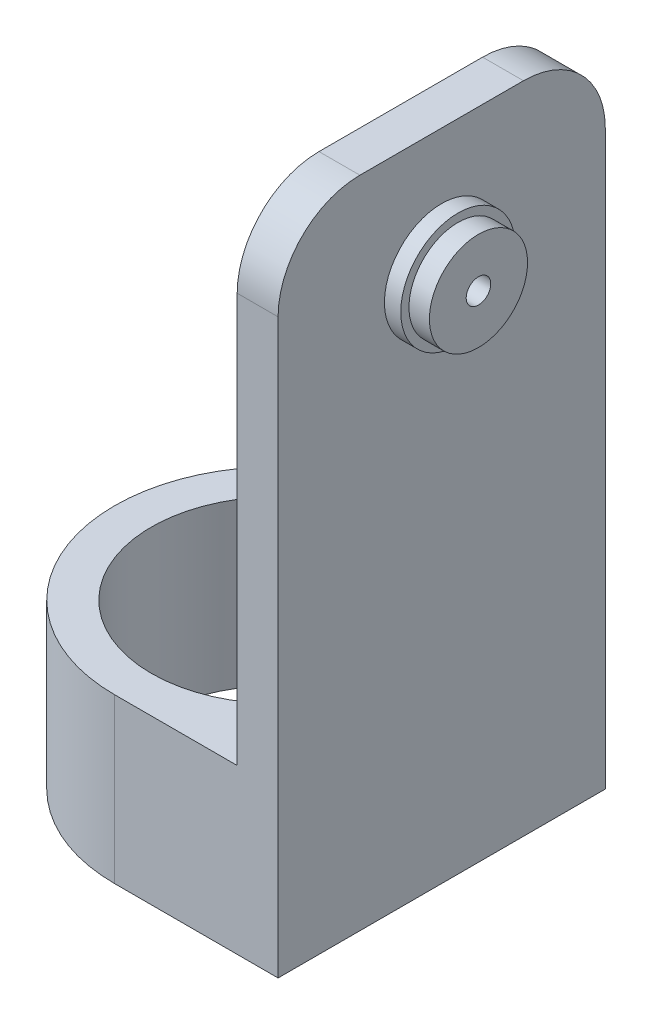
ISO-10303-21;
HEADER;
FILE_DESCRIPTION(('STEP AP214'),'2;1');
FILE_NAME('part.step','',(''),(''),'','','');
FILE_SCHEMA(('AUTOMOTIVE_DESIGN { 1 0 10303 214 1 1 1 1 }'));
ENDSEC;
DATA;
#1=APPLICATION_CONTEXT('core data for automotive mechanical design processes');
#2=APPLICATION_PROTOCOL_DEFINITION('international standard','automotive_design',2000,#1);
#3=PRODUCT_CONTEXT('',#1,'mechanical');
#4=PRODUCT('Part','Part','',(#3));
#5=PRODUCT_RELATED_PRODUCT_CATEGORY('part','',(#4));
#6=PRODUCT_DEFINITION_FORMATION('','',#4);
#7=PRODUCT_DEFINITION_CONTEXT('part definition',#1,'design');
#8=PRODUCT_DEFINITION('design','',#6,#7);
#9=PRODUCT_DEFINITION_SHAPE('','',#8);
#10=(LENGTH_UNIT() NAMED_UNIT(*) SI_UNIT(.MILLI.,.METRE.));
#11=(NAMED_UNIT(*) PLANE_ANGLE_UNIT() SI_UNIT($,.RADIAN.));
#12=(NAMED_UNIT(*) SI_UNIT($,.STERADIAN.) SOLID_ANGLE_UNIT());
#13=UNCERTAINTY_MEASURE_WITH_UNIT(LENGTH_MEASURE(1.E-05),#10,'distance_accuracy_value','');
#14=(GEOMETRIC_REPRESENTATION_CONTEXT(3) GLOBAL_UNCERTAINTY_ASSIGNED_CONTEXT((#13)) GLOBAL_UNIT_ASSIGNED_CONTEXT((#10,
#11,#12)) REPRESENTATION_CONTEXT('',''));
#15=CARTESIAN_POINT('',(0.,0.,0.));
#16=DIRECTION('',(0.,0.,1.));
#17=DIRECTION('',(1.,0.,0.));
#18=AXIS2_PLACEMENT_3D('',#15,#16,#17);
#19=CARTESIAN_POINT('',(0.,20.,0.));
#20=DIRECTION('',(0.,1.,0.));
#21=DIRECTION('',(0.,0.,1.));
#22=AXIS2_PLACEMENT_3D('',#19,#20,#21);
#23=PLANE('',#22);
#24=DIRECTION('',(0.,0.,1.));
#25=VECTOR('',#24,1.);
#26=CARTESIAN_POINT('',(15.,20.,-20.));
#27=LINE('',#26,#25);
#28=CARTESIAN_POINT('',(15.,20.,-20.));
#29=VERTEX_POINT('',#28);
#30=CARTESIAN_POINT('',(15.,20.,-3.90512483795333));
#31=VERTEX_POINT('',#30);
#32=EDGE_CURVE('E145',#29,#31,#27,.T.);
#33=ORIENTED_EDGE('',*,*,#32,.F.);
#34=DIRECTION('',(-1.,0.,0.));
#35=VECTOR('',#34,1.);
#36=CARTESIAN_POINT('',(0.,20.,-20.));
#37=LINE('',#36,#35);
#38=CARTESIAN_POINT('',(0.,20.,-20.));
#39=VERTEX_POINT('',#38);
#40=EDGE_CURVE('E213',#29,#39,#37,.T.);
#41=ORIENTED_EDGE('',*,*,#40,.T.);
#42=CARTESIAN_POINT('',(0.,20.,0.));
#43=DIRECTION('',(0.,1.,0.));
#44=DIRECTION('',(0.,0.,1.));
#45=AXIS2_PLACEMENT_3D('',#42,#43,#44);
#46=CIRCLE('',#45,20.);
#47=CARTESIAN_POINT('',(0.,20.,20.));
#48=VERTEX_POINT('',#47);
#49=EDGE_CURVE('E130',#39,#48,#46,.T.);
#50=ORIENTED_EDGE('',*,*,#49,.T.);
#51=DIRECTION('',(1.,0.,0.));
#52=VECTOR('',#51,1.);
#53=CARTESIAN_POINT('',(0.,20.,20.));
#54=LINE('',#53,#52);
#55=CARTESIAN_POINT('',(15.,20.,20.));
#56=VERTEX_POINT('',#55);
#57=EDGE_CURVE('E116',#48,#56,#54,.T.);
#58=ORIENTED_EDGE('',*,*,#57,.T.);
#59=CARTESIAN_POINT('',(15.,20.,3.90512483795332));
#60=VERTEX_POINT('',#59);
#61=EDGE_CURVE('E127',#60,#56,#27,.T.);
#62=ORIENTED_EDGE('',*,*,#61,.F.);
#63=CARTESIAN_POINT('',(0.,20.,0.));
#64=DIRECTION('',(0.,1.,0.));
#65=DIRECTION('',(0.,0.,1.));
#66=AXIS2_PLACEMENT_3D('',#63,#64,#65);
#67=CIRCLE('',#66,15.5);
#68=EDGE_CURVE('E218',#31,#60,#67,.T.);
#69=ORIENTED_EDGE('',*,*,#68,.F.);
#70=EDGE_LOOP('',(#33,#41,#50,#58,#62,#69));
#71=FACE_BOUND('',#70,.T.);
#72=ADVANCED_FACE('F40',(#71),#23,.T.);
#73=CARTESIAN_POINT('',(0.,0.,0.));
#74=DIRECTION('',(0.,1.,0.));
#75=DIRECTION('',(0.,0.,1.));
#76=AXIS2_PLACEMENT_3D('',#73,#74,#75);
#77=PLANE('',#76);
#78=DIRECTION('',(0.,0.,-1.));
#79=VECTOR('',#78,1.);
#80=CARTESIAN_POINT('',(20.,0.,-20.));
#81=LINE('',#80,#79);
#82=CARTESIAN_POINT('',(20.,0.,20.));
#83=VERTEX_POINT('',#82);
#84=CARTESIAN_POINT('',(20.,0.,-20.));
#85=VERTEX_POINT('',#84);
#86=EDGE_CURVE('E224',#83,#85,#81,.T.);
#87=ORIENTED_EDGE('',*,*,#86,.F.);
#88=DIRECTION('',(1.,0.,0.));
#89=VECTOR('',#88,1.);
#90=CARTESIAN_POINT('',(0.,0.,20.));
#91=LINE('',#90,#89);
#92=CARTESIAN_POINT('',(0.,0.,20.));
#93=VERTEX_POINT('',#92);
#94=EDGE_CURVE('E228',#93,#83,#91,.T.);
#95=ORIENTED_EDGE('',*,*,#94,.F.);
#96=CARTESIAN_POINT('',(0.,0.,0.));
#97=DIRECTION('',(0.,1.,0.));
#98=DIRECTION('',(0.,0.,1.));
#99=AXIS2_PLACEMENT_3D('',#96,#97,#98);
#100=CIRCLE('',#99,20.);
#101=CARTESIAN_POINT('',(0.,0.,-20.));
#102=VERTEX_POINT('',#101);
#103=EDGE_CURVE('E235',#102,#93,#100,.T.);
#104=ORIENTED_EDGE('',*,*,#103,.F.);
#105=DIRECTION('',(-1.,0.,0.));
#106=VECTOR('',#105,1.);
#107=CARTESIAN_POINT('',(0.,0.,-20.));
#108=LINE('',#107,#106);
#109=EDGE_CURVE('E232',#85,#102,#108,.T.);
#110=ORIENTED_EDGE('',*,*,#109,.F.);
#111=EDGE_LOOP('',(#87,#95,#104,#110));
#112=FACE_BOUND('',#111,.T.);
#113=CARTESIAN_POINT('',(0.,0.,0.));
#114=DIRECTION('',(0.,1.,0.));
#115=DIRECTION('',(0.,0.,1.));
#116=AXIS2_PLACEMENT_3D('',#113,#114,#115);
#117=CIRCLE('',#116,15.5);
#118=CARTESIAN_POINT('',(0.,0.,15.5));
#119=VERTEX_POINT('',#118);
#120=EDGE_CURVE('E214',#119,#119,#117,.T.);
#121=ORIENTED_EDGE('',*,*,#120,.T.);
#122=EDGE_LOOP('',(#121));
#123=FACE_BOUND('',#122,.T.);
#124=ADVANCED_FACE('F253',(#112,#123),#77,.F.);
#125=CARTESIAN_POINT('',(20.,20.,-20.));
#126=DIRECTION('',(-1.,0.,0.));
#127=DIRECTION('',(0.,0.,1.));
#128=AXIS2_PLACEMENT_3D('',#125,#126,#127);
#129=PLANE('',#128);
#130=CARTESIAN_POINT('',(20.,65.,0.));
#131=DIRECTION('',(-1.,0.,0.));
#132=DIRECTION('',(0.,0.,1.));
#133=AXIS2_PLACEMENT_3D('',#130,#131,#132);
#134=CIRCLE('',#133,7.);
#135=CARTESIAN_POINT('',(20.,65.,7.));
#136=VERTEX_POINT('',#135);
#137=EDGE_CURVE('E142',#136,#136,#134,.F.);
#138=ORIENTED_EDGE('',*,*,#137,.F.);
#139=EDGE_LOOP('',(#138));
#140=FACE_BOUND('',#139,.T.);
#141=DIRECTION('',(0.,-1.,0.));
#142=VECTOR('',#141,1.);
#143=CARTESIAN_POINT('',(20.,20.,-20.));
#144=LINE('',#143,#142);
#145=CARTESIAN_POINT('',(20.,70.,-20.));
#146=VERTEX_POINT('',#145);
#147=EDGE_CURVE('E143',#146,#85,#144,.T.);
#148=ORIENTED_EDGE('',*,*,#147,.F.);
#149=CARTESIAN_POINT('',(20.,70.,-10.));
#150=DIRECTION('',(-1.,0.,0.));
#151=DIRECTION('',(0.,0.,1.));
#152=AXIS2_PLACEMENT_3D('',#149,#150,#151);
#153=CIRCLE('',#152,10.);
#154=CARTESIAN_POINT('',(20.,80.,-10.));
#155=VERTEX_POINT('',#154);
#156=EDGE_CURVE('E49',#146,#155,#153,.F.);
#157=ORIENTED_EDGE('',*,*,#156,.T.);
#158=DIRECTION('',(0.,0.,-1.));
#159=VECTOR('',#158,1.);
#160=CARTESIAN_POINT('',(20.,80.,-20.));
#161=LINE('',#160,#159);
#162=CARTESIAN_POINT('',(20.,80.,10.));
#163=VERTEX_POINT('',#162);
#164=EDGE_CURVE('E157',#163,#155,#161,.T.);
#165=ORIENTED_EDGE('',*,*,#164,.F.);
#166=CARTESIAN_POINT('',(20.,70.,10.));
#167=DIRECTION('',(-1.,0.,0.));
#168=DIRECTION('',(0.,0.,1.));
#169=AXIS2_PLACEMENT_3D('',#166,#167,#168);
#170=CIRCLE('',#169,10.);
#171=CARTESIAN_POINT('',(20.,70.,20.));
#172=VERTEX_POINT('',#171);
#173=EDGE_CURVE('E56',#163,#172,#170,.F.);
#174=ORIENTED_EDGE('',*,*,#173,.T.);
#175=DIRECTION('',(0.,-1.,0.));
#176=VECTOR('',#175,1.);
#177=CARTESIAN_POINT('',(20.,20.,20.));
#178=LINE('',#177,#176);
#179=EDGE_CURVE('E133',#172,#83,#178,.T.);
#180=ORIENTED_EDGE('',*,*,#179,.T.);
#181=ORIENTED_EDGE('',*,*,#86,.T.);
#182=EDGE_LOOP('',(#148,#157,#165,#174,#180,#181));
#183=FACE_BOUND('',#182,.T.);
#184=ADVANCED_FACE('F206',(#140,#183),#129,.F.);
#185=CARTESIAN_POINT('',(0.,20.,-20.));
#186=DIRECTION('',(0.,0.,1.));
#187=DIRECTION('',(1.,0.,0.));
#188=AXIS2_PLACEMENT_3D('',#185,#186,#187);
#189=PLANE('',#188);
#190=DIRECTION('',(0.,-1.,0.));
#191=VECTOR('',#190,1.);
#192=CARTESIAN_POINT('',(15.,80.,-20.));
#193=LINE('',#192,#191);
#194=CARTESIAN_POINT('',(15.,70.,-20.));
#195=VERTEX_POINT('',#194);
#196=EDGE_CURVE('E122',#195,#29,#193,.T.);
#197=ORIENTED_EDGE('',*,*,#196,.F.);
#198=DIRECTION('',(-1.,0.,0.));
#199=VECTOR('',#198,1.);
#200=CARTESIAN_POINT('',(0.,70.,-20.));
#201=LINE('',#200,#199);
#202=EDGE_CURVE('E64',#195,#146,#201,.F.);
#203=ORIENTED_EDGE('',*,*,#202,.T.);
#204=ORIENTED_EDGE('',*,*,#147,.T.);
#205=ORIENTED_EDGE('',*,*,#109,.T.);
#206=DIRECTION('',(0.,-1.,0.));
#207=VECTOR('',#206,1.);
#208=CARTESIAN_POINT('',(0.,20.,-20.));
#209=LINE('',#208,#207);
#210=EDGE_CURVE('E153',#39,#102,#209,.T.);
#211=ORIENTED_EDGE('',*,*,#210,.F.);
#212=ORIENTED_EDGE('',*,*,#40,.F.);
#213=EDGE_LOOP('',(#197,#203,#204,#205,#211,#212));
#214=FACE_BOUND('',#213,.T.);
#215=ADVANCED_FACE('F211',(#214),#189,.F.);
#216=CARTESIAN_POINT('',(0.,20.,0.));
#217=DIRECTION('',(0.,-1.,0.));
#218=DIRECTION('',(0.,0.,-1.));
#219=AXIS2_PLACEMENT_3D('',#216,#217,#218);
#220=CYLINDRICAL_SURFACE('',#219,20.);
#221=ORIENTED_EDGE('',*,*,#103,.T.);
#222=DIRECTION('',(0.,-1.,0.));
#223=VECTOR('',#222,1.);
#224=CARTESIAN_POINT('',(0.,20.,20.));
#225=LINE('',#224,#223);
#226=EDGE_CURVE('E242',#48,#93,#225,.T.);
#227=ORIENTED_EDGE('',*,*,#226,.F.);
#228=ORIENTED_EDGE('',*,*,#49,.F.);
#229=ORIENTED_EDGE('',*,*,#210,.T.);
#230=EDGE_LOOP('',(#221,#227,#228,#229));
#231=FACE_BOUND('',#230,.T.);
#232=ADVANCED_FACE('F248',(#231),#220,.T.);
#233=CARTESIAN_POINT('',(0.,20.,20.));
#234=DIRECTION('',(0.,0.,-1.));
#235=DIRECTION('',(-1.,0.,0.));
#236=AXIS2_PLACEMENT_3D('',#233,#234,#235);
#237=PLANE('',#236);
#238=ORIENTED_EDGE('',*,*,#179,.F.);
#239=DIRECTION('',(1.,0.,0.));
#240=VECTOR('',#239,1.);
#241=CARTESIAN_POINT('',(0.,70.,20.));
#242=LINE('',#241,#240);
#243=CARTESIAN_POINT('',(15.,70.,20.));
#244=VERTEX_POINT('',#243);
#245=EDGE_CURVE('E11',#172,#244,#242,.F.);
#246=ORIENTED_EDGE('',*,*,#245,.T.);
#247=DIRECTION('',(0.,-1.,0.));
#248=VECTOR('',#247,1.);
#249=CARTESIAN_POINT('',(15.,80.,20.));
#250=LINE('',#249,#248);
#251=EDGE_CURVE('E112',#244,#56,#250,.T.);
#252=ORIENTED_EDGE('',*,*,#251,.T.);
#253=ORIENTED_EDGE('',*,*,#57,.F.);
#254=ORIENTED_EDGE('',*,*,#226,.T.);
#255=ORIENTED_EDGE('',*,*,#94,.T.);
#256=EDGE_LOOP('',(#238,#246,#252,#253,#254,#255));
#257=FACE_BOUND('',#256,.T.);
#258=ADVANCED_FACE('F114',(#257),#237,.F.);
#259=CARTESIAN_POINT('',(0.,20.,0.));
#260=DIRECTION('',(0.,-1.,0.));
#261=DIRECTION('',(0.,0.,-1.));
#262=AXIS2_PLACEMENT_3D('',#259,#260,#261);
#263=CYLINDRICAL_SURFACE('',#262,15.5);
#264=EDGE_CURVE('E221',#60,#31,#67,.T.);
#265=ORIENTED_EDGE('',*,*,#264,.T.);
#266=ORIENTED_EDGE('',*,*,#68,.T.);
#267=EDGE_LOOP('',(#265,#266));
#268=FACE_BOUND('',#267,.T.);
#269=ORIENTED_EDGE('',*,*,#120,.F.);
#270=EDGE_LOOP('',(#269));
#271=FACE_BOUND('',#270,.T.);
#272=ADVANCED_FACE('F259',(#268,#271),#263,.F.);
#273=CARTESIAN_POINT('',(0.,20.,0.));
#274=DIRECTION('',(0.,-1.,0.));
#275=DIRECTION('',(0.,0.,-1.));
#276=AXIS2_PLACEMENT_3D('',#273,#274,#275);
#277=PLANE('',#276);
#278=ORIENTED_EDGE('',*,*,#264,.F.);
#279=EDGE_CURVE('E140',#31,#60,#27,.T.);
#280=ORIENTED_EDGE('',*,*,#279,.F.);
#281=EDGE_LOOP('',(#278,#280));
#282=FACE_BOUND('',#281,.T.);
#283=ADVANCED_FACE('F261',(#282),#277,.T.);
#284=CARTESIAN_POINT('',(15.,80.,-20.));
#285=DIRECTION('',(1.,0.,0.));
#286=DIRECTION('',(0.,0.,-1.));
#287=AXIS2_PLACEMENT_3D('',#284,#285,#286);
#288=PLANE('',#287);
#289=CARTESIAN_POINT('',(15.,65.,0.));
#290=DIRECTION('',(1.,0.,0.));
#291=DIRECTION('',(0.,0.,-1.));
#292=AXIS2_PLACEMENT_3D('',#289,#290,#291);
#293=CIRCLE('',#292,1.5);
#294=CARTESIAN_POINT('',(15.,65.,-1.5));
#295=VERTEX_POINT('',#294);
#296=EDGE_CURVE('E172',#295,#295,#293,.T.);
#297=ORIENTED_EDGE('',*,*,#296,.T.);
#298=EDGE_LOOP('',(#297));
#299=FACE_BOUND('',#298,.T.);
#300=DIRECTION('',(0.,0.,1.));
#301=VECTOR('',#300,1.);
#302=CARTESIAN_POINT('',(15.,80.,-20.));
#303=LINE('',#302,#301);
#304=CARTESIAN_POINT('',(15.,80.,-10.));
#305=VERTEX_POINT('',#304);
#306=CARTESIAN_POINT('',(15.,80.,10.));
#307=VERTEX_POINT('',#306);
#308=EDGE_CURVE('E123',#305,#307,#303,.T.);
#309=ORIENTED_EDGE('',*,*,#308,.F.);
#310=CARTESIAN_POINT('',(15.,70.,-10.));
#311=DIRECTION('',(1.,0.,0.));
#312=DIRECTION('',(0.,0.,-1.));
#313=AXIS2_PLACEMENT_3D('',#310,#311,#312);
#314=CIRCLE('',#313,10.);
#315=EDGE_CURVE('E199',#305,#195,#314,.F.);
#316=ORIENTED_EDGE('',*,*,#315,.T.);
#317=ORIENTED_EDGE('',*,*,#196,.T.);
#318=ORIENTED_EDGE('',*,*,#32,.T.);
#319=ORIENTED_EDGE('',*,*,#279,.T.);
#320=ORIENTED_EDGE('',*,*,#61,.T.);
#321=ORIENTED_EDGE('',*,*,#251,.F.);
#322=CARTESIAN_POINT('',(15.,70.,10.));
#323=DIRECTION('',(1.,0.,0.));
#324=DIRECTION('',(0.,0.,-1.));
#325=AXIS2_PLACEMENT_3D('',#322,#323,#324);
#326=CIRCLE('',#325,10.);
#327=EDGE_CURVE('E190',#244,#307,#326,.F.);
#328=ORIENTED_EDGE('',*,*,#327,.T.);
#329=EDGE_LOOP('',(#309,#316,#317,#318,#319,#320,#321,#328));
#330=FACE_BOUND('',#329,.T.);
#331=ADVANCED_FACE('F137',(#299,#330),#288,.F.);
#332=CARTESIAN_POINT('',(0.,80.,0.));
#333=DIRECTION('',(0.,-1.,0.));
#334=DIRECTION('',(0.,0.,-1.));
#335=AXIS2_PLACEMENT_3D('',#332,#333,#334);
#336=PLANE('',#335);
#337=ORIENTED_EDGE('',*,*,#164,.T.);
#338=DIRECTION('',(-1.,0.,0.));
#339=VECTOR('',#338,1.);
#340=CARTESIAN_POINT('',(0.,80.,-10.));
#341=LINE('',#340,#339);
#342=EDGE_CURVE('E188',#155,#305,#341,.T.);
#343=ORIENTED_EDGE('',*,*,#342,.T.);
#344=ORIENTED_EDGE('',*,*,#308,.T.);
#345=DIRECTION('',(1.,0.,0.));
#346=VECTOR('',#345,1.);
#347=CARTESIAN_POINT('',(0.,80.,10.));
#348=LINE('',#347,#346);
#349=EDGE_CURVE('E186',#307,#163,#348,.T.);
#350=ORIENTED_EDGE('',*,*,#349,.T.);
#351=EDGE_LOOP('',(#337,#343,#344,#350));
#352=FACE_BOUND('',#351,.T.);
#353=ADVANCED_FACE('F185',(#352),#336,.F.);
#354=CARTESIAN_POINT('',(22.,65.,0.));
#355=DIRECTION('',(-1.,0.,0.));
#356=DIRECTION('',(0.,0.,1.));
#357=AXIS2_PLACEMENT_3D('',#354,#355,#356);
#358=CYLINDRICAL_SURFACE('',#357,7.);
#359=CARTESIAN_POINT('',(22.,65.,0.));
#360=DIRECTION('',(1.,0.,0.));
#361=DIRECTION('',(0.,0.,-1.));
#362=AXIS2_PLACEMENT_3D('',#359,#360,#361);
#363=CIRCLE('',#362,7.);
#364=CARTESIAN_POINT('',(22.,65.,-7.));
#365=VERTEX_POINT('',#364);
#366=EDGE_CURVE('E159',#365,#365,#363,.T.);
#367=ORIENTED_EDGE('',*,*,#366,.F.);
#368=EDGE_LOOP('',(#367));
#369=FACE_BOUND('',#368,.T.);
#370=ORIENTED_EDGE('',*,*,#137,.T.);
#371=EDGE_LOOP('',(#370));
#372=FACE_BOUND('',#371,.T.);
#373=ADVANCED_FACE('F307',(#369,#372),#358,.T.);
#374=CARTESIAN_POINT('',(22.,65.,0.));
#375=DIRECTION('',(1.,0.,0.));
#376=DIRECTION('',(0.,0.,-1.));
#377=AXIS2_PLACEMENT_3D('',#374,#375,#376);
#378=PLANE('',#377);
#379=CARTESIAN_POINT('',(22.,65.,0.));
#380=DIRECTION('',(1.,0.,0.));
#381=DIRECTION('',(0.,0.,-1.));
#382=AXIS2_PLACEMENT_3D('',#379,#380,#381);
#383=CIRCLE('',#382,6.);
#384=CARTESIAN_POINT('',(22.,65.,-6.));
#385=VERTEX_POINT('',#384);
#386=EDGE_CURVE('E150',#385,#385,#383,.T.);
#387=ORIENTED_EDGE('',*,*,#386,.F.);
#388=EDGE_LOOP('',(#387));
#389=FACE_BOUND('',#388,.T.);
#390=ORIENTED_EDGE('',*,*,#366,.T.);
#391=EDGE_LOOP('',(#390));
#392=FACE_BOUND('',#391,.T.);
#393=ADVANCED_FACE('F303',(#389,#392),#378,.T.);
#394=CARTESIAN_POINT('',(24.5,65.,0.));
#395=DIRECTION('',(-1.,0.,0.));
#396=DIRECTION('',(0.,0.,1.));
#397=AXIS2_PLACEMENT_3D('',#394,#395,#396);
#398=CYLINDRICAL_SURFACE('',#397,6.);
#399=CARTESIAN_POINT('',(24.5,65.,0.));
#400=DIRECTION('',(1.,0.,0.));
#401=DIRECTION('',(0.,0.,-1.));
#402=AXIS2_PLACEMENT_3D('',#399,#400,#401);
#403=CIRCLE('',#402,6.);
#404=CARTESIAN_POINT('',(24.5,65.,-6.));
#405=VERTEX_POINT('',#404);
#406=EDGE_CURVE('E164',#405,#405,#403,.T.);
#407=ORIENTED_EDGE('',*,*,#406,.F.);
#408=EDGE_LOOP('',(#407));
#409=FACE_BOUND('',#408,.T.);
#410=ORIENTED_EDGE('',*,*,#386,.T.);
#411=EDGE_LOOP('',(#410));
#412=FACE_BOUND('',#411,.T.);
#413=ADVANCED_FACE('F295',(#409,#412),#398,.T.);
#414=CARTESIAN_POINT('',(24.5,65.,0.));
#415=DIRECTION('',(1.,0.,0.));
#416=DIRECTION('',(0.,0.,-1.));
#417=AXIS2_PLACEMENT_3D('',#414,#415,#416);
#418=PLANE('',#417);
#419=CARTESIAN_POINT('',(24.5,65.,0.));
#420=DIRECTION('',(1.,0.,0.));
#421=DIRECTION('',(0.,0.,-1.));
#422=AXIS2_PLACEMENT_3D('',#419,#420,#421);
#423=CIRCLE('',#422,1.5);
#424=CARTESIAN_POINT('',(24.5,65.,-1.5));
#425=VERTEX_POINT('',#424);
#426=EDGE_CURVE('E320',#425,#425,#423,.T.);
#427=ORIENTED_EDGE('',*,*,#426,.F.);
#428=EDGE_LOOP('',(#427));
#429=FACE_BOUND('',#428,.T.);
#430=ORIENTED_EDGE('',*,*,#406,.T.);
#431=EDGE_LOOP('',(#430));
#432=FACE_BOUND('',#431,.T.);
#433=ADVANCED_FACE('F289',(#429,#432),#418,.T.);
#434=CARTESIAN_POINT('',(-20.,65.,0.));
#435=DIRECTION('',(1.,0.,0.));
#436=DIRECTION('',(0.,0.,-1.));
#437=AXIS2_PLACEMENT_3D('',#434,#435,#436);
#438=CYLINDRICAL_SURFACE('',#437,1.5);
#439=ORIENTED_EDGE('',*,*,#426,.T.);
#440=EDGE_LOOP('',(#439));
#441=FACE_BOUND('',#440,.T.);
#442=ORIENTED_EDGE('',*,*,#296,.F.);
#443=EDGE_LOOP('',(#442));
#444=FACE_BOUND('',#443,.T.);
#445=ADVANCED_FACE('F284',(#441,#444),#438,.F.);
#446=CARTESIAN_POINT('',(0.,70.,-10.));
#447=DIRECTION('',(-1.,0.,0.));
#448=DIRECTION('',(0.,0.,1.));
#449=AXIS2_PLACEMENT_3D('',#446,#447,#448);
#450=CYLINDRICAL_SURFACE('',#449,10.);
#451=ORIENTED_EDGE('',*,*,#156,.F.);
#452=ORIENTED_EDGE('',*,*,#202,.F.);
#453=ORIENTED_EDGE('',*,*,#315,.F.);
#454=ORIENTED_EDGE('',*,*,#342,.F.);
#455=EDGE_LOOP('',(#451,#452,#453,#454));
#456=FACE_BOUND('',#455,.T.);
#457=ADVANCED_FACE('F209',(#456),#450,.T.);
#458=CARTESIAN_POINT('',(0.,70.,10.));
#459=DIRECTION('',(1.,0.,0.));
#460=DIRECTION('',(0.,0.,-1.));
#461=AXIS2_PLACEMENT_3D('',#458,#459,#460);
#462=CYLINDRICAL_SURFACE('',#461,10.);
#463=ORIENTED_EDGE('',*,*,#327,.F.);
#464=ORIENTED_EDGE('',*,*,#245,.F.);
#465=ORIENTED_EDGE('',*,*,#173,.F.);
#466=ORIENTED_EDGE('',*,*,#349,.F.);
#467=EDGE_LOOP('',(#463,#464,#465,#466));
#468=FACE_BOUND('',#467,.T.);
#469=ADVANCED_FACE('F42',(#468),#462,.T.);
#470=CLOSED_SHELL('',(#72,#124,#184,#215,#232,#258,#272,#283,#331,#353,#373,#393,#413,#433,#445,
#457,#469));
#471=MANIFOLD_SOLID_BREP('B2',#470);
#472=ADVANCED_BREP_SHAPE_REPRESENTATION('',(#18,#471),#14);
#473=SHAPE_DEFINITION_REPRESENTATION(#9,#472);
ENDSEC;
END-ISO-10303-21;
